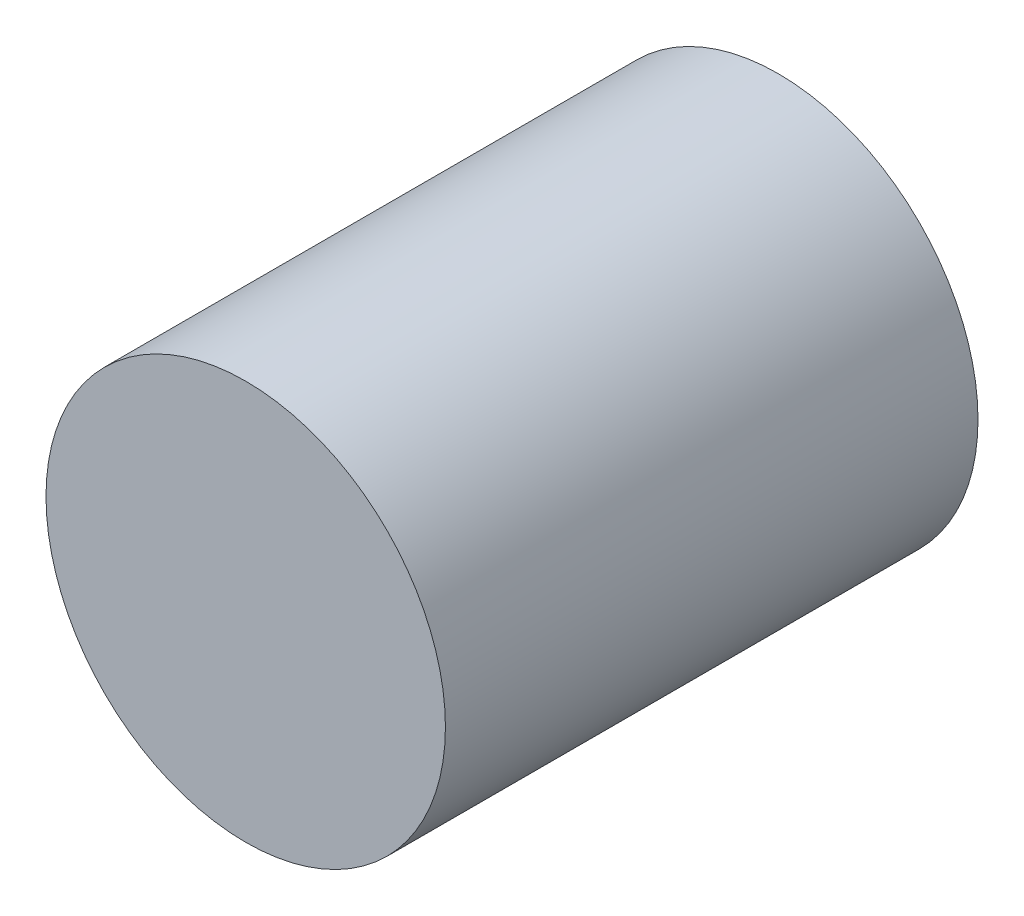
ISO-10303-21;
HEADER;
FILE_DESCRIPTION(('STEP AP214'),'2;1');
FILE_NAME('part.step','',(''),(''),'','','');
FILE_SCHEMA(('AUTOMOTIVE_DESIGN { 1 0 10303 214 1 1 1 1 }'));
ENDSEC;
DATA;
#1=APPLICATION_CONTEXT('core data for automotive mechanical design processes');
#2=APPLICATION_PROTOCOL_DEFINITION('international standard','automotive_design',2000,#1);
#3=PRODUCT_CONTEXT('',#1,'mechanical');
#4=PRODUCT('Part','Part','',(#3));
#5=PRODUCT_RELATED_PRODUCT_CATEGORY('part','',(#4));
#6=PRODUCT_DEFINITION_FORMATION('','',#4);
#7=PRODUCT_DEFINITION_CONTEXT('part definition',#1,'design');
#8=PRODUCT_DEFINITION('design','',#6,#7);
#9=PRODUCT_DEFINITION_SHAPE('','',#8);
#10=(LENGTH_UNIT() NAMED_UNIT(*) SI_UNIT(.MILLI.,.METRE.));
#11=(NAMED_UNIT(*) PLANE_ANGLE_UNIT() SI_UNIT($,.RADIAN.));
#12=(NAMED_UNIT(*) SI_UNIT($,.STERADIAN.) SOLID_ANGLE_UNIT());
#13=UNCERTAINTY_MEASURE_WITH_UNIT(LENGTH_MEASURE(1.E-05),#10,'distance_accuracy_value','');
#14=(GEOMETRIC_REPRESENTATION_CONTEXT(3) GLOBAL_UNCERTAINTY_ASSIGNED_CONTEXT((#13)) GLOBAL_UNIT_ASSIGNED_CONTEXT((#10,
#11,#12)) REPRESENTATION_CONTEXT('',''));
#15=CARTESIAN_POINT('',(0.,0.,0.));
#16=DIRECTION('',(0.,0.,1.));
#17=DIRECTION('',(1.,0.,0.));
#18=AXIS2_PLACEMENT_3D('',#15,#16,#17);
#19=CARTESIAN_POINT('',(0.,0.,4.));
#20=DIRECTION('',(0.,0.,-1.));
#21=DIRECTION('',(-1.,0.,0.));
#22=AXIS2_PLACEMENT_3D('',#19,#20,#21);
#23=CYLINDRICAL_SURFACE('',#22,1.5);
#24=CARTESIAN_POINT('',(0.,0.,4.));
#25=DIRECTION('',(0.,0.,1.));
#26=DIRECTION('',(1.,0.,0.));
#27=AXIS2_PLACEMENT_3D('',#24,#25,#26);
#28=CIRCLE('',#27,1.5);
#29=CARTESIAN_POINT('',(1.5,0.,4.));
#30=VERTEX_POINT('',#29);
#31=EDGE_CURVE('E10',#30,#30,#28,.T.);
#32=ORIENTED_EDGE('',*,*,#31,.F.);
#33=EDGE_LOOP('',(#32));
#34=FACE_BOUND('',#33,.T.);
#35=CARTESIAN_POINT('',(0.,0.,0.));
#36=DIRECTION('',(0.,0.,1.));
#37=DIRECTION('',(1.,0.,0.));
#38=AXIS2_PLACEMENT_3D('',#35,#36,#37);
#39=CIRCLE('',#38,1.5);
#40=CARTESIAN_POINT('',(1.5,0.,0.));
#41=VERTEX_POINT('',#40);
#42=EDGE_CURVE('E33',#41,#41,#39,.T.);
#43=ORIENTED_EDGE('',*,*,#42,.T.);
#44=EDGE_LOOP('',(#43));
#45=FACE_BOUND('',#44,.T.);
#46=ADVANCED_FACE('F30',(#34,#45),#23,.T.);
#47=CARTESIAN_POINT('',(0.,0.,4.));
#48=DIRECTION('',(0.,0.,1.));
#49=DIRECTION('',(1.,0.,0.));
#50=AXIS2_PLACEMENT_3D('',#47,#48,#49);
#51=PLANE('',#50);
#52=ORIENTED_EDGE('',*,*,#31,.T.);
#53=EDGE_LOOP('',(#52));
#54=FACE_BOUND('',#53,.T.);
#55=ADVANCED_FACE('F45',(#54),#51,.T.);
#56=CARTESIAN_POINT('',(0.,0.,0.));
#57=DIRECTION('',(0.,0.,1.));
#58=DIRECTION('',(1.,0.,0.));
#59=AXIS2_PLACEMENT_3D('',#56,#57,#58);
#60=PLANE('',#59);
#61=ORIENTED_EDGE('',*,*,#42,.F.);
#62=EDGE_LOOP('',(#61));
#63=FACE_BOUND('',#62,.T.);
#64=ADVANCED_FACE('F43',(#63),#60,.F.);
#65=CLOSED_SHELL('',(#46,#55,#64));
#66=MANIFOLD_SOLID_BREP('B2',#65);
#67=ADVANCED_BREP_SHAPE_REPRESENTATION('',(#18,#66),#14);
#68=SHAPE_DEFINITION_REPRESENTATION(#9,#67);
ENDSEC;
END-ISO-10303-21;
